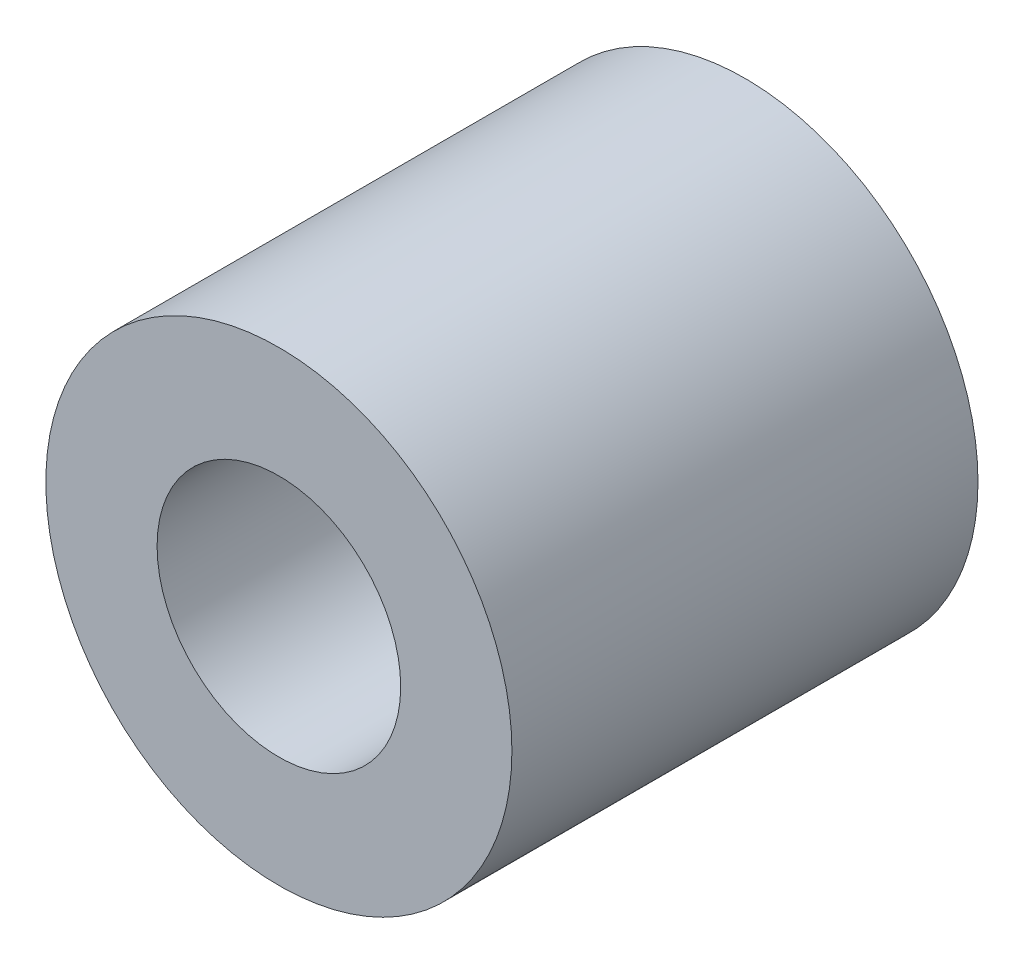
ISO-10303-21;
HEADER;
FILE_DESCRIPTION(('STEP AP214'),'2;1');
FILE_NAME('part.step','',(''),(''),'','','');
FILE_SCHEMA(('AUTOMOTIVE_DESIGN { 1 0 10303 214 1 1 1 1 }'));
ENDSEC;
DATA;
#1=APPLICATION_CONTEXT('core data for automotive mechanical design processes');
#2=APPLICATION_PROTOCOL_DEFINITION('international standard','automotive_design',2000,#1);
#3=PRODUCT_CONTEXT('',#1,'mechanical');
#4=PRODUCT('Part','Part','',(#3));
#5=PRODUCT_RELATED_PRODUCT_CATEGORY('part','',(#4));
#6=PRODUCT_DEFINITION_FORMATION('','',#4);
#7=PRODUCT_DEFINITION_CONTEXT('part definition',#1,'design');
#8=PRODUCT_DEFINITION('design','',#6,#7);
#9=PRODUCT_DEFINITION_SHAPE('','',#8);
#10=(LENGTH_UNIT() NAMED_UNIT(*) SI_UNIT(.MILLI.,.METRE.));
#11=(NAMED_UNIT(*) PLANE_ANGLE_UNIT() SI_UNIT($,.RADIAN.));
#12=(NAMED_UNIT(*) SI_UNIT($,.STERADIAN.) SOLID_ANGLE_UNIT());
#13=UNCERTAINTY_MEASURE_WITH_UNIT(LENGTH_MEASURE(1.E-05),#10,'distance_accuracy_value','');
#14=(GEOMETRIC_REPRESENTATION_CONTEXT(3) GLOBAL_UNCERTAINTY_ASSIGNED_CONTEXT((#13)) GLOBAL_UNIT_ASSIGNED_CONTEXT((#10,
#11,#12)) REPRESENTATION_CONTEXT('',''));
#15=CARTESIAN_POINT('',(0.,0.,0.));
#16=DIRECTION('',(0.,0.,1.));
#17=DIRECTION('',(1.,0.,0.));
#18=AXIS2_PLACEMENT_3D('',#15,#16,#17);
#19=CARTESIAN_POINT('',(0.,0.,4.7625));
#20=DIRECTION('',(0.,0.,1.));
#21=DIRECTION('',(1.,0.,0.));
#22=AXIS2_PLACEMENT_3D('',#19,#20,#21);
#23=PLANE('',#22);
#24=CARTESIAN_POINT('',(0.,0.,4.7625));
#25=DIRECTION('',(0.,0.,1.));
#26=DIRECTION('',(1.,0.,0.));
#27=AXIS2_PLACEMENT_3D('',#24,#25,#26);
#28=CIRCLE('',#27,4.7625);
#29=CARTESIAN_POINT('',(4.7625,0.,4.7625));
#30=VERTEX_POINT('',#29);
#31=EDGE_CURVE('E10',#30,#30,#28,.T.);
#32=ORIENTED_EDGE('',*,*,#31,.T.);
#33=EDGE_LOOP('',(#32));
#34=FACE_BOUND('',#33,.T.);
#35=CARTESIAN_POINT('',(0.,0.,4.7625));
#36=DIRECTION('',(0.,0.,1.));
#37=DIRECTION('',(1.,0.,0.));
#38=AXIS2_PLACEMENT_3D('',#35,#36,#37);
#39=CIRCLE('',#38,2.4892);
#40=CARTESIAN_POINT('',(2.4892,0.,4.7625));
#41=VERTEX_POINT('',#40);
#42=EDGE_CURVE('E50',#41,#41,#39,.T.);
#43=ORIENTED_EDGE('',*,*,#42,.F.);
#44=EDGE_LOOP('',(#43));
#45=FACE_BOUND('',#44,.T.);
#46=ADVANCED_FACE('F37',(#34,#45),#23,.T.);
#47=CARTESIAN_POINT('',(0.,0.,-4.7625));
#48=DIRECTION('',(0.,0.,1.));
#49=DIRECTION('',(1.,0.,0.));
#50=AXIS2_PLACEMENT_3D('',#47,#48,#49);
#51=PLANE('',#50);
#52=CARTESIAN_POINT('',(0.,0.,-4.7625));
#53=DIRECTION('',(0.,0.,1.));
#54=DIRECTION('',(1.,0.,0.));
#55=AXIS2_PLACEMENT_3D('',#52,#53,#54);
#56=CIRCLE('',#55,4.7625);
#57=CARTESIAN_POINT('',(4.7625,0.,-4.7625));
#58=VERTEX_POINT('',#57);
#59=EDGE_CURVE('E41',#58,#58,#56,.T.);
#60=ORIENTED_EDGE('',*,*,#59,.F.);
#61=EDGE_LOOP('',(#60));
#62=FACE_BOUND('',#61,.T.);
#63=CARTESIAN_POINT('',(0.,0.,-4.7625));
#64=DIRECTION('',(0.,0.,1.));
#65=DIRECTION('',(1.,0.,0.));
#66=AXIS2_PLACEMENT_3D('',#63,#64,#65);
#67=CIRCLE('',#66,2.4892);
#68=CARTESIAN_POINT('',(2.4892,0.,-4.7625));
#69=VERTEX_POINT('',#68);
#70=EDGE_CURVE('E52',#69,#69,#67,.T.);
#71=ORIENTED_EDGE('',*,*,#70,.T.);
#72=EDGE_LOOP('',(#71));
#73=FACE_BOUND('',#72,.T.);
#74=ADVANCED_FACE('F64',(#62,#73),#51,.F.);
#75=CARTESIAN_POINT('',(0.,0.,4.7625));
#76=DIRECTION('',(0.,0.,-1.));
#77=DIRECTION('',(-1.,0.,0.));
#78=AXIS2_PLACEMENT_3D('',#75,#76,#77);
#79=CYLINDRICAL_SURFACE('',#78,4.7625);
#80=ORIENTED_EDGE('',*,*,#31,.F.);
#81=EDGE_LOOP('',(#80));
#82=FACE_BOUND('',#81,.T.);
#83=ORIENTED_EDGE('',*,*,#59,.T.);
#84=EDGE_LOOP('',(#83));
#85=FACE_BOUND('',#84,.T.);
#86=ADVANCED_FACE('F39',(#82,#85),#79,.T.);
#87=CARTESIAN_POINT('',(0.,0.,4.7625));
#88=DIRECTION('',(0.,0.,-1.));
#89=DIRECTION('',(-1.,0.,0.));
#90=AXIS2_PLACEMENT_3D('',#87,#88,#89);
#91=CYLINDRICAL_SURFACE('',#90,2.4892);
#92=ORIENTED_EDGE('',*,*,#42,.T.);
#93=EDGE_LOOP('',(#92));
#94=FACE_BOUND('',#93,.T.);
#95=ORIENTED_EDGE('',*,*,#70,.F.);
#96=EDGE_LOOP('',(#95));
#97=FACE_BOUND('',#96,.T.);
#98=ADVANCED_FACE('F60',(#94,#97),#91,.F.);
#99=CLOSED_SHELL('',(#46,#74,#86,#98));
#100=MANIFOLD_SOLID_BREP('B2',#99);
#101=ADVANCED_BREP_SHAPE_REPRESENTATION('',(#18,#100),#14);
#102=SHAPE_DEFINITION_REPRESENTATION(#9,#101);
ENDSEC;
END-ISO-10303-21;
